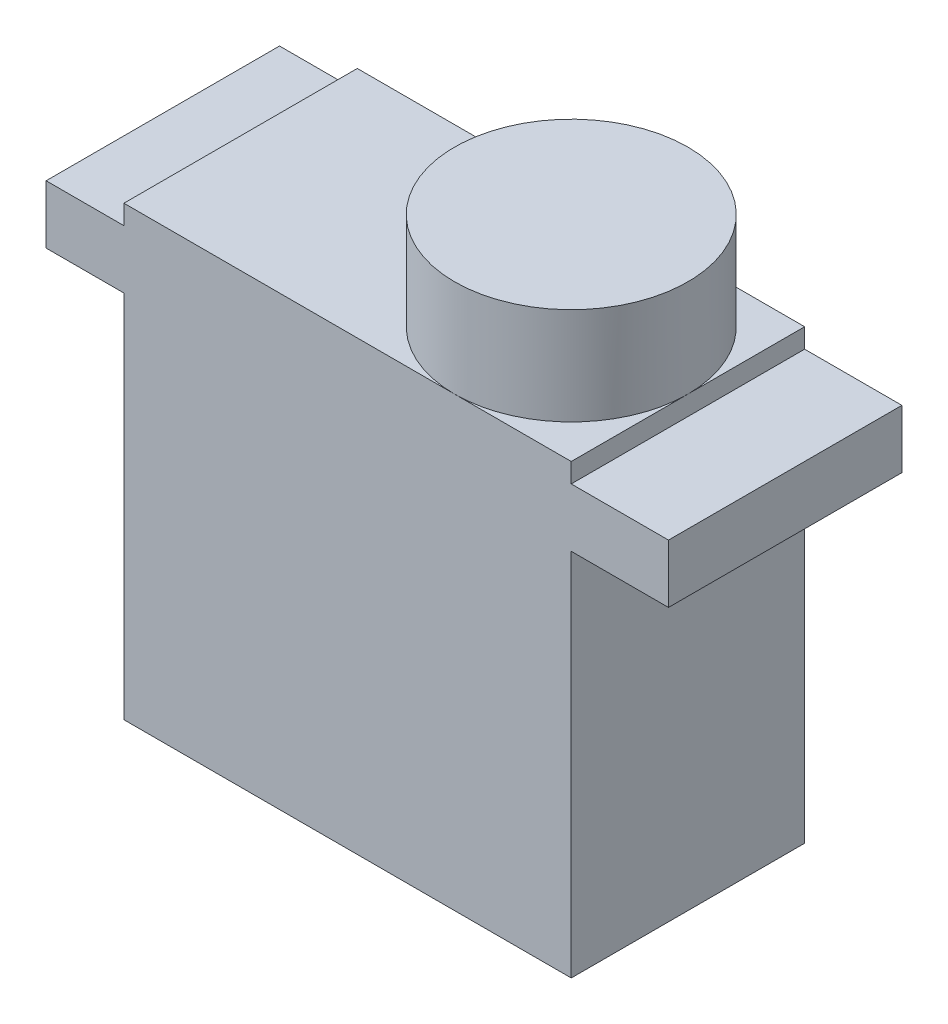
ISO-10303-21;
HEADER;
FILE_DESCRIPTION(('STEP AP214'),'2;1');
FILE_NAME('part.step','',(''),(''),'','','');
FILE_SCHEMA(('AUTOMOTIVE_DESIGN { 1 0 10303 214 1 1 1 1 }'));
ENDSEC;
DATA;
#1=APPLICATION_CONTEXT('core data for automotive mechanical design processes');
#2=APPLICATION_PROTOCOL_DEFINITION('international standard','automotive_design',2000,#1);
#3=PRODUCT_CONTEXT('',#1,'mechanical');
#4=PRODUCT('Part','Part','',(#3));
#5=PRODUCT_RELATED_PRODUCT_CATEGORY('part','',(#4));
#6=PRODUCT_DEFINITION_FORMATION('','',#4);
#7=PRODUCT_DEFINITION_CONTEXT('part definition',#1,'design');
#8=PRODUCT_DEFINITION('design','',#6,#7);
#9=PRODUCT_DEFINITION_SHAPE('','',#8);
#10=(LENGTH_UNIT() NAMED_UNIT(*) SI_UNIT(.MILLI.,.METRE.));
#11=(NAMED_UNIT(*) PLANE_ANGLE_UNIT() SI_UNIT($,.RADIAN.));
#12=(NAMED_UNIT(*) SI_UNIT($,.STERADIAN.) SOLID_ANGLE_UNIT());
#13=UNCERTAINTY_MEASURE_WITH_UNIT(LENGTH_MEASURE(1.E-05),#10,'distance_accuracy_value','');
#14=(GEOMETRIC_REPRESENTATION_CONTEXT(3) GLOBAL_UNCERTAINTY_ASSIGNED_CONTEXT((#13)) GLOBAL_UNIT_ASSIGNED_CONTEXT((#10,
#11,#12)) REPRESENTATION_CONTEXT('',''));
#15=CARTESIAN_POINT('',(0.,0.,0.));
#16=DIRECTION('',(0.,0.,1.));
#17=DIRECTION('',(1.,0.,0.));
#18=AXIS2_PLACEMENT_3D('',#15,#16,#17);
#19=CARTESIAN_POINT('',(0.,23.,0.));
#20=DIRECTION('',(0.,1.,0.));
#21=DIRECTION('',(0.,0.,1.));
#22=AXIS2_PLACEMENT_3D('',#19,#20,#21);
#23=PLANE('',#22);
#24=CARTESIAN_POINT('',(17.,23.,-6.));
#25=DIRECTION('',(0.,1.,0.));
#26=DIRECTION('',(0.,0.,1.));
#27=AXIS2_PLACEMENT_3D('',#24,#25,#26);
#28=CIRCLE('',#27,6.);
#29=CARTESIAN_POINT('',(17.,23.,0.));
#30=VERTEX_POINT('',#29);
#31=CARTESIAN_POINT('',(23.,23.,-6.));
#32=VERTEX_POINT('',#31);
#33=EDGE_CURVE('E44',#30,#32,#28,.T.);
#34=ORIENTED_EDGE('',*,*,#33,.F.);
#35=DIRECTION('',(1.,0.,0.));
#36=VECTOR('',#35,1.);
#37=CARTESIAN_POINT('',(0.,23.,0.));
#38=LINE('',#37,#36);
#39=CARTESIAN_POINT('',(23.,23.,0.));
#40=VERTEX_POINT('',#39);
#41=EDGE_CURVE('E139',#30,#40,#38,.T.);
#42=ORIENTED_EDGE('',*,*,#41,.T.);
#43=DIRECTION('',(0.,0.,-1.));
#44=VECTOR('',#43,1.);
#45=CARTESIAN_POINT('',(23.,23.,0.));
#46=LINE('',#45,#44);
#47=EDGE_CURVE('E152',#40,#32,#46,.T.);
#48=ORIENTED_EDGE('',*,*,#47,.T.);
#49=EDGE_LOOP('',(#34,#42,#48));
#50=FACE_BOUND('',#49,.T.);
#51=ADVANCED_FACE('F33',(#50),#23,.T.);
#52=CARTESIAN_POINT('',(17.,23.,-12.));
#53=VERTEX_POINT('',#52);
#54=EDGE_CURVE('E11',#32,#53,#28,.T.);
#55=ORIENTED_EDGE('',*,*,#54,.F.);
#56=CARTESIAN_POINT('',(23.,23.,-12.));
#57=VERTEX_POINT('',#56);
#58=EDGE_CURVE('E138',#32,#57,#46,.T.);
#59=ORIENTED_EDGE('',*,*,#58,.T.);
#60=DIRECTION('',(-1.,0.,0.));
#61=VECTOR('',#60,1.);
#62=CARTESIAN_POINT('',(0.,23.,-12.));
#63=LINE('',#62,#61);
#64=EDGE_CURVE('E237',#57,#53,#63,.T.);
#65=ORIENTED_EDGE('',*,*,#64,.T.);
#66=EDGE_LOOP('',(#55,#59,#65));
#67=FACE_BOUND('',#66,.T.);
#68=ADVANCED_FACE('F277',(#67),#23,.T.);
#69=CARTESIAN_POINT('',(0.,22.,0.));
#70=DIRECTION('',(0.,1.,0.));
#71=DIRECTION('',(0.,0.,1.));
#72=AXIS2_PLACEMENT_3D('',#69,#70,#71);
#73=PLANE('',#72);
#74=DIRECTION('',(0.,0.,1.));
#75=VECTOR('',#74,1.);
#76=CARTESIAN_POINT('',(0.,22.,0.));
#77=LINE('',#76,#75);
#78=CARTESIAN_POINT('',(0.,22.,-12.));
#79=VERTEX_POINT('',#78);
#80=CARTESIAN_POINT('',(0.,22.,0.));
#81=VERTEX_POINT('',#80);
#82=EDGE_CURVE('E182',#79,#81,#77,.T.);
#83=ORIENTED_EDGE('',*,*,#82,.F.);
#84=DIRECTION('',(-1.,0.,0.));
#85=VECTOR('',#84,1.);
#86=CARTESIAN_POINT('',(-4.,22.,-12.));
#87=LINE('',#86,#85);
#88=CARTESIAN_POINT('',(-4.,22.,-12.));
#89=VERTEX_POINT('',#88);
#90=EDGE_CURVE('E196',#79,#89,#87,.T.);
#91=ORIENTED_EDGE('',*,*,#90,.T.);
#92=DIRECTION('',(0.,0.,1.));
#93=VECTOR('',#92,1.);
#94=CARTESIAN_POINT('',(-4.,22.,0.));
#95=LINE('',#94,#93);
#96=CARTESIAN_POINT('',(-4.,22.,0.));
#97=VERTEX_POINT('',#96);
#98=EDGE_CURVE('E205',#89,#97,#95,.T.);
#99=ORIENTED_EDGE('',*,*,#98,.T.);
#100=DIRECTION('',(1.,0.,0.));
#101=VECTOR('',#100,1.);
#102=CARTESIAN_POINT('',(-4.,22.,0.));
#103=LINE('',#102,#101);
#104=EDGE_CURVE('E213',#97,#81,#103,.T.);
#105=ORIENTED_EDGE('',*,*,#104,.T.);
#106=EDGE_LOOP('',(#83,#91,#99,#105));
#107=FACE_BOUND('',#106,.T.);
#108=ADVANCED_FACE('F293',(#107),#73,.T.);
#109=CARTESIAN_POINT('',(0.,44.9422435421457,0.));
#110=DIRECTION('',(1.,0.,0.));
#111=DIRECTION('',(0.,0.,-1.));
#112=AXIS2_PLACEMENT_3D('',#109,#110,#111);
#113=PLANE('',#112);
#114=DIRECTION('',(0.,0.,1.));
#115=VECTOR('',#114,1.);
#116=CARTESIAN_POINT('',(0.,19.,0.));
#117=LINE('',#116,#115);
#118=CARTESIAN_POINT('',(0.,19.,-12.));
#119=VERTEX_POINT('',#118);
#120=CARTESIAN_POINT('',(0.,19.,0.));
#121=VERTEX_POINT('',#120);
#122=EDGE_CURVE('E159',#119,#121,#117,.T.);
#123=ORIENTED_EDGE('',*,*,#122,.F.);
#124=DIRECTION('',(0.,-1.,0.));
#125=VECTOR('',#124,1.);
#126=CARTESIAN_POINT('',(0.,44.9422435421457,-12.));
#127=LINE('',#126,#125);
#128=CARTESIAN_POINT('',(0.,0.,-12.));
#129=VERTEX_POINT('',#128);
#130=EDGE_CURVE('E272',#119,#129,#127,.T.);
#131=ORIENTED_EDGE('',*,*,#130,.T.);
#132=DIRECTION('',(0.,0.,1.));
#133=VECTOR('',#132,1.);
#134=CARTESIAN_POINT('',(0.,0.,0.));
#135=LINE('',#134,#133);
#136=CARTESIAN_POINT('',(0.,0.,0.));
#137=VERTEX_POINT('',#136);
#138=EDGE_CURVE('E273',#129,#137,#135,.T.);
#139=ORIENTED_EDGE('',*,*,#138,.T.);
#140=DIRECTION('',(0.,-1.,0.));
#141=VECTOR('',#140,1.);
#142=CARTESIAN_POINT('',(0.,44.9422435421457,0.));
#143=LINE('',#142,#141);
#144=EDGE_CURVE('E327',#121,#137,#143,.T.);
#145=ORIENTED_EDGE('',*,*,#144,.F.);
#146=EDGE_LOOP('',(#123,#131,#139,#145));
#147=FACE_BOUND('',#146,.T.);
#148=ADVANCED_FACE('F35',(#147),#113,.F.);
#149=CARTESIAN_POINT('',(0.,44.9422435421457,0.));
#150=DIRECTION('',(0.,0.,-1.));
#151=DIRECTION('',(-1.,0.,0.));
#152=AXIS2_PLACEMENT_3D('',#149,#150,#151);
#153=PLANE('',#152);
#154=DIRECTION('',(0.,-1.,0.));
#155=VECTOR('',#154,1.);
#156=CARTESIAN_POINT('',(23.,44.9422435421457,0.));
#157=LINE('',#156,#155);
#158=CARTESIAN_POINT('',(23.,19.,0.));
#159=VERTEX_POINT('',#158);
#160=CARTESIAN_POINT('',(23.,0.,0.));
#161=VERTEX_POINT('',#160);
#162=EDGE_CURVE('E253',#159,#161,#157,.T.);
#163=ORIENTED_EDGE('',*,*,#162,.F.);
#164=DIRECTION('',(1.,0.,0.));
#165=VECTOR('',#164,1.);
#166=CARTESIAN_POINT('',(-4.,19.,0.));
#167=LINE('',#166,#165);
#168=CARTESIAN_POINT('',(28.,19.,0.));
#169=VERTEX_POINT('',#168);
#170=EDGE_CURVE('E222',#159,#169,#167,.T.);
#171=ORIENTED_EDGE('',*,*,#170,.T.);
#172=DIRECTION('',(0.,-1.,0.));
#173=VECTOR('',#172,1.);
#174=CARTESIAN_POINT('',(28.,56.1760149812701,0.));
#175=LINE('',#174,#173);
#176=CARTESIAN_POINT('',(28.,22.,0.));
#177=VERTEX_POINT('',#176);
#178=EDGE_CURVE('E224',#177,#169,#175,.T.);
#179=ORIENTED_EDGE('',*,*,#178,.F.);
#180=CARTESIAN_POINT('',(23.,22.,0.));
#181=VERTEX_POINT('',#180);
#182=EDGE_CURVE('E271',#181,#177,#103,.T.);
#183=ORIENTED_EDGE('',*,*,#182,.F.);
#184=DIRECTION('',(0.,-1.,0.));
#185=VECTOR('',#184,1.);
#186=CARTESIAN_POINT('',(23.,48.9422435421457,0.));
#187=LINE('',#186,#185);
#188=EDGE_CURVE('E147',#40,#181,#187,.T.);
#189=ORIENTED_EDGE('',*,*,#188,.F.);
#190=ORIENTED_EDGE('',*,*,#41,.F.);
#191=CARTESIAN_POINT('',(0.,23.,0.));
#192=VERTEX_POINT('',#191);
#193=EDGE_CURVE('E130',#192,#30,#38,.T.);
#194=ORIENTED_EDGE('',*,*,#193,.F.);
#195=DIRECTION('',(0.,-1.,0.));
#196=VECTOR('',#195,1.);
#197=CARTESIAN_POINT('',(0.,48.9422435421457,0.));
#198=LINE('',#197,#196);
#199=EDGE_CURVE('E178',#192,#81,#198,.T.);
#200=ORIENTED_EDGE('',*,*,#199,.T.);
#201=ORIENTED_EDGE('',*,*,#104,.F.);
#202=DIRECTION('',(0.,-1.,0.));
#203=VECTOR('',#202,1.);
#204=CARTESIAN_POINT('',(-4.,56.1760149812701,0.));
#205=LINE('',#204,#203);
#206=CARTESIAN_POINT('',(-4.,19.,0.));
#207=VERTEX_POINT('',#206);
#208=EDGE_CURVE('E219',#97,#207,#205,.T.);
#209=ORIENTED_EDGE('',*,*,#208,.T.);
#210=EDGE_CURVE('E228',#207,#121,#167,.T.);
#211=ORIENTED_EDGE('',*,*,#210,.T.);
#212=ORIENTED_EDGE('',*,*,#144,.T.);
#213=DIRECTION('',(1.,0.,0.));
#214=VECTOR('',#213,1.);
#215=CARTESIAN_POINT('',(0.,0.,0.));
#216=LINE('',#215,#214);
#217=EDGE_CURVE('E338',#137,#161,#216,.T.);
#218=ORIENTED_EDGE('',*,*,#217,.T.);
#219=EDGE_LOOP('',(#163,#171,#179,#183,#189,#190,#194,#200,#201,#209,#211,#212,#218));
#220=FACE_BOUND('',#219,.T.);
#221=ADVANCED_FACE('F144',(#220),#153,.F.);
#222=CARTESIAN_POINT('',(23.,44.9422435421457,0.));
#223=DIRECTION('',(-1.,0.,0.));
#224=DIRECTION('',(0.,0.,1.));
#225=AXIS2_PLACEMENT_3D('',#222,#223,#224);
#226=PLANE('',#225);
#227=DIRECTION('',(0.,0.,-1.));
#228=VECTOR('',#227,1.);
#229=CARTESIAN_POINT('',(23.,19.,0.));
#230=LINE('',#229,#228);
#231=CARTESIAN_POINT('',(23.,19.,-12.));
#232=VERTEX_POINT('',#231);
#233=EDGE_CURVE('E157',#159,#232,#230,.T.);
#234=ORIENTED_EDGE('',*,*,#233,.F.);
#235=ORIENTED_EDGE('',*,*,#162,.T.);
#236=DIRECTION('',(0.,0.,-1.));
#237=VECTOR('',#236,1.);
#238=CARTESIAN_POINT('',(23.,0.,0.));
#239=LINE('',#238,#237);
#240=CARTESIAN_POINT('',(23.,0.,-12.));
#241=VERTEX_POINT('',#240);
#242=EDGE_CURVE('E349',#161,#241,#239,.T.);
#243=ORIENTED_EDGE('',*,*,#242,.T.);
#244=DIRECTION('',(0.,-1.,0.));
#245=VECTOR('',#244,1.);
#246=CARTESIAN_POINT('',(23.,44.9422435421457,-12.));
#247=LINE('',#246,#245);
#248=EDGE_CURVE('E264',#232,#241,#247,.T.);
#249=ORIENTED_EDGE('',*,*,#248,.F.);
#250=EDGE_LOOP('',(#234,#235,#243,#249));
#251=FACE_BOUND('',#250,.T.);
#252=ADVANCED_FACE('F312',(#251),#226,.F.);
#253=CARTESIAN_POINT('',(0.,44.9422435421457,-12.));
#254=DIRECTION('',(0.,0.,1.));
#255=DIRECTION('',(1.,0.,0.));
#256=AXIS2_PLACEMENT_3D('',#253,#254,#255);
#257=PLANE('',#256);
#258=ORIENTED_EDGE('',*,*,#130,.F.);
#259=DIRECTION('',(-1.,0.,0.));
#260=VECTOR('',#259,1.);
#261=CARTESIAN_POINT('',(-4.,19.,-12.));
#262=LINE('',#261,#260);
#263=CARTESIAN_POINT('',(-4.,19.,-12.));
#264=VERTEX_POINT('',#263);
#265=EDGE_CURVE('E208',#119,#264,#262,.T.);
#266=ORIENTED_EDGE('',*,*,#265,.T.);
#267=DIRECTION('',(0.,-1.,0.));
#268=VECTOR('',#267,1.);
#269=CARTESIAN_POINT('',(-4.,56.1760149812701,-12.));
#270=LINE('',#269,#268);
#271=EDGE_CURVE('E198',#89,#264,#270,.T.);
#272=ORIENTED_EDGE('',*,*,#271,.F.);
#273=ORIENTED_EDGE('',*,*,#90,.F.);
#274=DIRECTION('',(0.,-1.,0.));
#275=VECTOR('',#274,1.);
#276=CARTESIAN_POINT('',(0.,48.9422435421457,-12.));
#277=LINE('',#276,#275);
#278=CARTESIAN_POINT('',(0.,23.,-12.));
#279=VERTEX_POINT('',#278);
#280=EDGE_CURVE('E164',#279,#79,#277,.T.);
#281=ORIENTED_EDGE('',*,*,#280,.F.);
#282=EDGE_CURVE('E194',#53,#279,#63,.T.);
#283=ORIENTED_EDGE('',*,*,#282,.F.);
#284=ORIENTED_EDGE('',*,*,#64,.F.);
#285=DIRECTION('',(0.,-1.,0.));
#286=VECTOR('',#285,1.);
#287=CARTESIAN_POINT('',(23.,48.9422435421457,-12.));
#288=LINE('',#287,#286);
#289=CARTESIAN_POINT('',(23.,22.,-12.));
#290=VERTEX_POINT('',#289);
#291=EDGE_CURVE('E174',#57,#290,#288,.T.);
#292=ORIENTED_EDGE('',*,*,#291,.T.);
#293=CARTESIAN_POINT('',(28.,22.,-12.));
#294=VERTEX_POINT('',#293);
#295=EDGE_CURVE('E202',#294,#290,#87,.T.);
#296=ORIENTED_EDGE('',*,*,#295,.F.);
#297=DIRECTION('',(0.,-1.,0.));
#298=VECTOR('',#297,1.);
#299=CARTESIAN_POINT('',(28.,56.1760149812701,-12.));
#300=LINE('',#299,#298);
#301=CARTESIAN_POINT('',(28.,19.,-12.));
#302=VERTEX_POINT('',#301);
#303=EDGE_CURVE('E229',#294,#302,#300,.T.);
#304=ORIENTED_EDGE('',*,*,#303,.T.);
#305=EDGE_CURVE('E203',#302,#232,#262,.T.);
#306=ORIENTED_EDGE('',*,*,#305,.T.);
#307=ORIENTED_EDGE('',*,*,#248,.T.);
#308=DIRECTION('',(-1.,0.,0.));
#309=VECTOR('',#308,1.);
#310=CARTESIAN_POINT('',(0.,0.,-12.));
#311=LINE('',#310,#309);
#312=EDGE_CURVE('E329',#241,#129,#311,.T.);
#313=ORIENTED_EDGE('',*,*,#312,.T.);
#314=EDGE_LOOP('',(#258,#266,#272,#273,#281,#283,#284,#292,#296,#304,#306,#307,#313));
#315=FACE_BOUND('',#314,.T.);
#316=ADVANCED_FACE('F192',(#315),#257,.F.);
#317=CARTESIAN_POINT('',(0.,0.,0.));
#318=DIRECTION('',(0.,-1.,0.));
#319=DIRECTION('',(0.,0.,-1.));
#320=AXIS2_PLACEMENT_3D('',#317,#318,#319);
#321=PLANE('',#320);
#322=ORIENTED_EDGE('',*,*,#138,.F.);
#323=ORIENTED_EDGE('',*,*,#312,.F.);
#324=ORIENTED_EDGE('',*,*,#242,.F.);
#325=ORIENTED_EDGE('',*,*,#217,.F.);
#326=EDGE_LOOP('',(#322,#323,#324,#325));
#327=FACE_BOUND('',#326,.T.);
#328=ADVANCED_FACE('F306',(#327),#321,.T.);
#329=CARTESIAN_POINT('',(0.,19.,0.));
#330=DIRECTION('',(0.,-1.,0.));
#331=DIRECTION('',(0.,0.,-1.));
#332=AXIS2_PLACEMENT_3D('',#329,#330,#331);
#333=PLANE('',#332);
#334=ORIENTED_EDGE('',*,*,#265,.F.);
#335=ORIENTED_EDGE('',*,*,#122,.T.);
#336=ORIENTED_EDGE('',*,*,#210,.F.);
#337=DIRECTION('',(0.,0.,1.));
#338=VECTOR('',#337,1.);
#339=CARTESIAN_POINT('',(-4.,19.,0.));
#340=LINE('',#339,#338);
#341=EDGE_CURVE('E223',#264,#207,#340,.T.);
#342=ORIENTED_EDGE('',*,*,#341,.F.);
#343=EDGE_LOOP('',(#334,#335,#336,#342));
#344=FACE_BOUND('',#343,.T.);
#345=ADVANCED_FACE('F297',(#344),#333,.T.);
#346=CARTESIAN_POINT('',(-4.,56.1760149812701,0.));
#347=DIRECTION('',(1.,0.,0.));
#348=DIRECTION('',(0.,0.,-1.));
#349=AXIS2_PLACEMENT_3D('',#346,#347,#348);
#350=PLANE('',#349);
#351=ORIENTED_EDGE('',*,*,#98,.F.);
#352=ORIENTED_EDGE('',*,*,#271,.T.);
#353=ORIENTED_EDGE('',*,*,#341,.T.);
#354=ORIENTED_EDGE('',*,*,#208,.F.);
#355=EDGE_LOOP('',(#351,#352,#353,#354));
#356=FACE_BOUND('',#355,.T.);
#357=ADVANCED_FACE('F300',(#356),#350,.F.);
#358=CARTESIAN_POINT('',(28.,56.1760149812701,0.));
#359=DIRECTION('',(-1.,0.,0.));
#360=DIRECTION('',(0.,0.,1.));
#361=AXIS2_PLACEMENT_3D('',#358,#359,#360);
#362=PLANE('',#361);
#363=DIRECTION('',(0.,0.,-1.));
#364=VECTOR('',#363,1.);
#365=CARTESIAN_POINT('',(28.,22.,0.));
#366=LINE('',#365,#364);
#367=EDGE_CURVE('E261',#177,#294,#366,.T.);
#368=ORIENTED_EDGE('',*,*,#367,.F.);
#369=ORIENTED_EDGE('',*,*,#178,.T.);
#370=DIRECTION('',(0.,0.,-1.));
#371=VECTOR('',#370,1.);
#372=CARTESIAN_POINT('',(28.,19.,0.));
#373=LINE('',#372,#371);
#374=EDGE_CURVE('E227',#169,#302,#373,.T.);
#375=ORIENTED_EDGE('',*,*,#374,.T.);
#376=ORIENTED_EDGE('',*,*,#303,.F.);
#377=EDGE_LOOP('',(#368,#369,#375,#376));
#378=FACE_BOUND('',#377,.T.);
#379=ADVANCED_FACE('F258',(#378),#362,.F.);
#380=ORIENTED_EDGE('',*,*,#170,.F.);
#381=ORIENTED_EDGE('',*,*,#233,.T.);
#382=ORIENTED_EDGE('',*,*,#305,.F.);
#383=ORIENTED_EDGE('',*,*,#374,.F.);
#384=EDGE_LOOP('',(#380,#381,#382,#383));
#385=FACE_BOUND('',#384,.T.);
#386=ADVANCED_FACE('F262',(#385),#333,.T.);
#387=DIRECTION('',(0.,0.,-1.));
#388=VECTOR('',#387,1.);
#389=CARTESIAN_POINT('',(23.,22.,0.));
#390=LINE('',#389,#388);
#391=EDGE_CURVE('E170',#181,#290,#390,.T.);
#392=ORIENTED_EDGE('',*,*,#391,.F.);
#393=ORIENTED_EDGE('',*,*,#182,.T.);
#394=ORIENTED_EDGE('',*,*,#367,.T.);
#395=ORIENTED_EDGE('',*,*,#295,.T.);
#396=EDGE_LOOP('',(#392,#393,#394,#395));
#397=FACE_BOUND('',#396,.T.);
#398=ADVANCED_FACE('F270',(#397),#73,.T.);
#399=CARTESIAN_POINT('',(0.,48.9422435421457,0.));
#400=DIRECTION('',(1.,0.,0.));
#401=DIRECTION('',(0.,0.,-1.));
#402=AXIS2_PLACEMENT_3D('',#399,#400,#401);
#403=PLANE('',#402);
#404=DIRECTION('',(0.,0.,1.));
#405=VECTOR('',#404,1.);
#406=CARTESIAN_POINT('',(0.,23.,0.));
#407=LINE('',#406,#405);
#408=EDGE_CURVE('E134',#279,#192,#407,.T.);
#409=ORIENTED_EDGE('',*,*,#408,.F.);
#410=ORIENTED_EDGE('',*,*,#280,.T.);
#411=ORIENTED_EDGE('',*,*,#82,.T.);
#412=ORIENTED_EDGE('',*,*,#199,.F.);
#413=EDGE_LOOP('',(#409,#410,#411,#412));
#414=FACE_BOUND('',#413,.T.);
#415=ADVANCED_FACE('F189',(#414),#403,.F.);
#416=CARTESIAN_POINT('',(23.,48.9422435421457,0.));
#417=DIRECTION('',(-1.,0.,0.));
#418=DIRECTION('',(0.,0.,1.));
#419=AXIS2_PLACEMENT_3D('',#416,#417,#418);
#420=PLANE('',#419);
#421=ORIENTED_EDGE('',*,*,#47,.F.);
#422=ORIENTED_EDGE('',*,*,#188,.T.);
#423=ORIENTED_EDGE('',*,*,#391,.T.);
#424=ORIENTED_EDGE('',*,*,#291,.F.);
#425=ORIENTED_EDGE('',*,*,#58,.F.);
#426=EDGE_LOOP('',(#421,#422,#423,#424,#425));
#427=FACE_BOUND('',#426,.T.);
#428=ADVANCED_FACE('F279',(#427),#420,.F.);
#429=EDGE_CURVE('E42',#53,#30,#28,.T.);
#430=ORIENTED_EDGE('',*,*,#429,.F.);
#431=ORIENTED_EDGE('',*,*,#282,.T.);
#432=ORIENTED_EDGE('',*,*,#408,.T.);
#433=ORIENTED_EDGE('',*,*,#193,.T.);
#434=EDGE_LOOP('',(#430,#431,#432,#433));
#435=FACE_BOUND('',#434,.T.);
#436=ADVANCED_FACE('F132',(#435),#23,.T.);
#437=CARTESIAN_POINT('',(17.,44.9705627484771,-6.));
#438=DIRECTION('',(0.,-1.,0.));
#439=DIRECTION('',(0.,0.,-1.));
#440=AXIS2_PLACEMENT_3D('',#437,#438,#439);
#441=CYLINDRICAL_SURFACE('',#440,6.);
#442=ORIENTED_EDGE('',*,*,#33,.T.);
#443=ORIENTED_EDGE('',*,*,#54,.T.);
#444=ORIENTED_EDGE('',*,*,#429,.T.);
#445=EDGE_LOOP('',(#442,#443,#444));
#446=FACE_BOUND('',#445,.T.);
#447=CARTESIAN_POINT('',(17.,28.,-6.));
#448=DIRECTION('',(0.,1.,0.));
#449=DIRECTION('',(0.,0.,1.));
#450=AXIS2_PLACEMENT_3D('',#447,#448,#449);
#451=CIRCLE('',#450,6.);
#452=CARTESIAN_POINT('',(17.,28.,0.));
#453=VERTEX_POINT('',#452);
#454=EDGE_CURVE('E154',#453,#453,#451,.T.);
#455=ORIENTED_EDGE('',*,*,#454,.F.);
#456=EDGE_LOOP('',(#455));
#457=FACE_BOUND('',#456,.T.);
#458=ADVANCED_FACE('F155',(#446,#457),#441,.T.);
#459=CARTESIAN_POINT('',(0.,28.,0.));
#460=DIRECTION('',(0.,1.,0.));
#461=DIRECTION('',(0.,0.,1.));
#462=AXIS2_PLACEMENT_3D('',#459,#460,#461);
#463=PLANE('',#462);
#464=ORIENTED_EDGE('',*,*,#454,.T.);
#465=EDGE_LOOP('',(#464));
#466=FACE_BOUND('',#465,.T.);
#467=ADVANCED_FACE('F426',(#466),#463,.T.);
#468=CLOSED_SHELL('',(#51,#68,#108,#148,#221,#252,#316,#328,#345,#357,#379,#386,#398,#415,#428,
#436,#458,#467));
#469=MANIFOLD_SOLID_BREP('B2',#468);
#470=ADVANCED_BREP_SHAPE_REPRESENTATION('',(#18,#469),#14);
#471=SHAPE_DEFINITION_REPRESENTATION(#9,#470);
ENDSEC;
END-ISO-10303-21;
